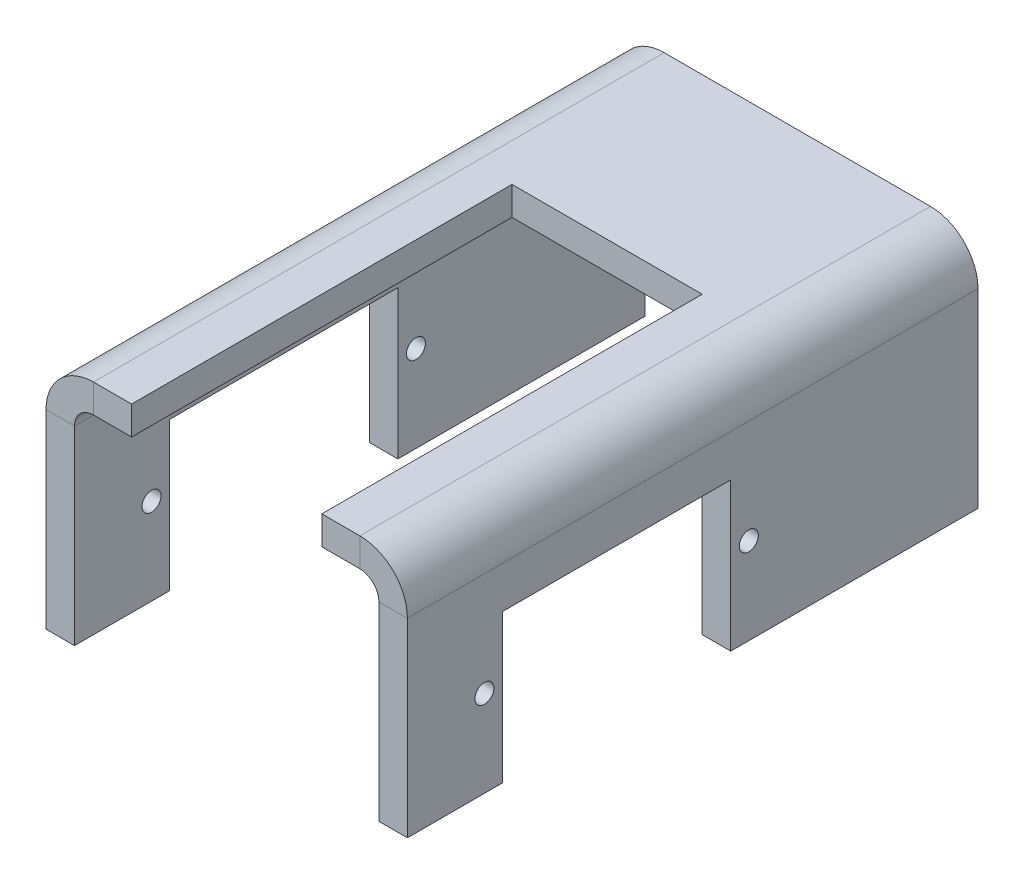
ISO-10303-21;
HEADER;
FILE_DESCRIPTION(('STEP AP214'),'2;1');
FILE_NAME('part.step','',(''),(''),'','','');
FILE_SCHEMA(('AUTOMOTIVE_DESIGN { 1 0 10303 214 1 1 1 1 }'));
ENDSEC;
DATA;
#1=APPLICATION_CONTEXT('core data for automotive mechanical design processes');
#2=APPLICATION_PROTOCOL_DEFINITION('international standard','automotive_design',2000,#1);
#3=PRODUCT_CONTEXT('',#1,'mechanical');
#4=PRODUCT('Part','Part','',(#3));
#5=PRODUCT_RELATED_PRODUCT_CATEGORY('part','',(#4));
#6=PRODUCT_DEFINITION_FORMATION('','',#4);
#7=PRODUCT_DEFINITION_CONTEXT('part definition',#1,'design');
#8=PRODUCT_DEFINITION('design','',#6,#7);
#9=PRODUCT_DEFINITION_SHAPE('','',#8);
#10=(LENGTH_UNIT() NAMED_UNIT(*) SI_UNIT(.MILLI.,.METRE.));
#11=(NAMED_UNIT(*) PLANE_ANGLE_UNIT() SI_UNIT($,.RADIAN.));
#12=(NAMED_UNIT(*) SI_UNIT($,.STERADIAN.) SOLID_ANGLE_UNIT());
#13=UNCERTAINTY_MEASURE_WITH_UNIT(LENGTH_MEASURE(1.E-05),#10,'distance_accuracy_value','');
#14=(GEOMETRIC_REPRESENTATION_CONTEXT(3) GLOBAL_UNCERTAINTY_ASSIGNED_CONTEXT((#13)) GLOBAL_UNIT_ASSIGNED_CONTEXT((#10,
#11,#12)) REPRESENTATION_CONTEXT('',''));
#15=CARTESIAN_POINT('',(0.,0.,0.));
#16=DIRECTION('',(0.,0.,1.));
#17=DIRECTION('',(1.,0.,0.));
#18=AXIS2_PLACEMENT_3D('',#15,#16,#17);
#19=CARTESIAN_POINT('',(15.5000000000001,-25.,-10.7919254658385));
#20=DIRECTION('',(0.,1.,0.));
#21=DIRECTION('',(-1.,0.,0.));
#22=AXIS2_PLACEMENT_3D('',#19,#20,#21);
#23=PLANE('',#22);
#24=DIRECTION('',(0.,0.,-1.));
#25=VECTOR('',#24,1.);
#26=CARTESIAN_POINT('',(12.5000000000001,-25.,-10.7919254658385));
#27=LINE('',#26,#25);
#28=CARTESIAN_POINT('',(12.5000000000001,-25.,49.2080745341615));
#29=VERTEX_POINT('',#28);
#30=CARTESIAN_POINT('',(12.5000000000001,-25.,39.2080745341615));
#31=VERTEX_POINT('',#30);
#32=EDGE_CURVE('E301',#29,#31,#27,.T.);
#33=ORIENTED_EDGE('',*,*,#32,.T.);
#34=DIRECTION('',(1.,0.,0.));
#35=VECTOR('',#34,1.);
#36=CARTESIAN_POINT('',(-22.5000000000001,-25.0000000000001,39.2080745341615));
#37=LINE('',#36,#35);
#38=CARTESIAN_POINT('',(15.5000000000001,-25.,39.2080745341615));
#39=VERTEX_POINT('',#38);
#40=EDGE_CURVE('E225',#31,#39,#37,.T.);
#41=ORIENTED_EDGE('',*,*,#40,.T.);
#42=DIRECTION('',(0.,0.,-1.));
#43=VECTOR('',#42,1.);
#44=CARTESIAN_POINT('',(15.5000000000001,-25.,-10.7919254658385));
#45=LINE('',#44,#43);
#46=CARTESIAN_POINT('',(15.5000000000001,-25.,49.2080745341615));
#47=VERTEX_POINT('',#46);
#48=EDGE_CURVE('E292',#47,#39,#45,.T.);
#49=ORIENTED_EDGE('',*,*,#48,.F.);
#50=DIRECTION('',(-1.,0.,0.));
#51=VECTOR('',#50,1.);
#52=CARTESIAN_POINT('',(15.5000000000001,-25.,49.2080745341615));
#53=LINE('',#52,#51);
#54=EDGE_CURVE('E308',#47,#29,#53,.T.);
#55=ORIENTED_EDGE('',*,*,#54,.T.);
#56=EDGE_LOOP('',(#33,#41,#49,#55));
#57=FACE_BOUND('',#56,.T.);
#58=ADVANCED_FACE('F39',(#57),#23,.F.);
#59=CARTESIAN_POINT('',(-22.5000000000001,-25.,-10.7919254658385));
#60=DIRECTION('',(0.,1.,0.));
#61=DIRECTION('',(-1.,0.,0.));
#62=AXIS2_PLACEMENT_3D('',#59,#60,#61);
#63=PLANE('',#62);
#64=DIRECTION('',(0.,0.,1.));
#65=VECTOR('',#64,1.);
#66=CARTESIAN_POINT('',(-22.5000000000001,-25.,-10.7919254658385));
#67=LINE('',#66,#65);
#68=CARTESIAN_POINT('',(-22.5000000000001,-25.0000000000001,39.2080745341615));
#69=VERTEX_POINT('',#68);
#70=CARTESIAN_POINT('',(-22.5000000000001,-25.,49.2080745341615));
#71=VERTEX_POINT('',#70);
#72=EDGE_CURVE('E207',#69,#71,#67,.T.);
#73=ORIENTED_EDGE('',*,*,#72,.F.);
#74=CARTESIAN_POINT('',(-19.5000000000001,-25.0000000000001,39.2080745341615));
#75=VERTEX_POINT('',#74);
#76=EDGE_CURVE('E218',#69,#75,#37,.T.);
#77=ORIENTED_EDGE('',*,*,#76,.T.);
#78=DIRECTION('',(0.,0.,1.));
#79=VECTOR('',#78,1.);
#80=CARTESIAN_POINT('',(-19.5000000000001,-25.,-10.7919254658385));
#81=LINE('',#80,#79);
#82=CARTESIAN_POINT('',(-19.5000000000001,-25.,49.2080745341615));
#83=VERTEX_POINT('',#82);
#84=EDGE_CURVE('E243',#75,#83,#81,.T.);
#85=ORIENTED_EDGE('',*,*,#84,.T.);
#86=DIRECTION('',(1.,0.,0.));
#87=VECTOR('',#86,1.);
#88=CARTESIAN_POINT('',(-22.5000000000001,-25.,49.2080745341615));
#89=LINE('',#88,#87);
#90=EDGE_CURVE('E229',#71,#83,#89,.T.);
#91=ORIENTED_EDGE('',*,*,#90,.F.);
#92=EDGE_LOOP('',(#73,#77,#85,#91));
#93=FACE_BOUND('',#92,.T.);
#94=ADVANCED_FACE('F227',(#93),#63,.F.);
#95=CARTESIAN_POINT('',(-19.5,-3.,49.2080745341615));
#96=DIRECTION('',(0.,0.,1.));
#97=DIRECTION('',(1.,0.,0.));
#98=AXIS2_PLACEMENT_3D('',#95,#96,#97);
#99=PLANE('',#98);
#100=DIRECTION('',(0.,-1.,0.));
#101=VECTOR('',#100,1.);
#102=CARTESIAN_POINT('',(-13.5,-3.,49.2080745341615));
#103=LINE('',#102,#101);
#104=CARTESIAN_POINT('',(-13.5,0.,49.2080745341615));
#105=VERTEX_POINT('',#104);
#106=CARTESIAN_POINT('',(-13.5,-3.00000000000001,49.2080745341615));
#107=VERTEX_POINT('',#106);
#108=EDGE_CURVE('E11',#105,#107,#103,.T.);
#109=ORIENTED_EDGE('',*,*,#108,.F.);
#110=DIRECTION('',(1.,0.,0.));
#111=VECTOR('',#110,1.);
#112=CARTESIAN_POINT('',(-19.5,0.,49.2080745341615));
#113=LINE('',#112,#111);
#114=CARTESIAN_POINT('',(-17.5,0.,49.2080745341615));
#115=VERTEX_POINT('',#114);
#116=EDGE_CURVE('E336',#115,#105,#113,.T.);
#117=ORIENTED_EDGE('',*,*,#116,.F.);
#118=DIRECTION('',(0.,1.,0.));
#119=VECTOR('',#118,1.);
#120=CARTESIAN_POINT('',(-17.5,-3.,49.2080745341615));
#121=LINE('',#120,#119);
#122=CARTESIAN_POINT('',(-17.5,-3.,49.2080745341615));
#123=VERTEX_POINT('',#122);
#124=EDGE_CURVE('E272',#123,#115,#121,.T.);
#125=ORIENTED_EDGE('',*,*,#124,.F.);
#126=DIRECTION('',(1.,0.,0.));
#127=VECTOR('',#126,1.);
#128=CARTESIAN_POINT('',(-19.5,-3.,49.2080745341615));
#129=LINE('',#128,#127);
#130=EDGE_CURVE('E337',#123,#107,#129,.T.);
#131=ORIENTED_EDGE('',*,*,#130,.T.);
#132=EDGE_LOOP('',(#109,#117,#125,#131));
#133=FACE_BOUND('',#132,.T.);
#134=ADVANCED_FACE('F531',(#133),#99,.T.);
#135=CARTESIAN_POINT('',(0.,-3.,0.));
#136=DIRECTION('',(0.,1.,0.));
#137=DIRECTION('',(0.,0.,1.));
#138=AXIS2_PLACEMENT_3D('',#135,#136,#137);
#139=PLANE('',#138);
#140=DIRECTION('',(-1.,0.,0.));
#141=VECTOR('',#140,1.);
#142=CARTESIAN_POINT('',(0.,-3.,9.2080745341615));
#143=LINE('',#142,#141);
#144=CARTESIAN_POINT('',(6.50000000000001,-3.00000000000001,9.2080745341615));
#145=VERTEX_POINT('',#144);
#146=CARTESIAN_POINT('',(-13.5,-3.00000000000001,9.2080745341615));
#147=VERTEX_POINT('',#146);
#148=EDGE_CURVE('E417',#145,#147,#143,.T.);
#149=ORIENTED_EDGE('',*,*,#148,.T.);
#150=DIRECTION('',(0.,0.,1.));
#151=VECTOR('',#150,1.);
#152=CARTESIAN_POINT('',(-13.5,-3.,0.));
#153=LINE('',#152,#151);
#154=EDGE_CURVE('E421',#147,#107,#153,.T.);
#155=ORIENTED_EDGE('',*,*,#154,.T.);
#156=ORIENTED_EDGE('',*,*,#130,.F.);
#157=DIRECTION('',(0.,0.,-1.));
#158=VECTOR('',#157,1.);
#159=CARTESIAN_POINT('',(-17.5,-3.,-10.7919254658385));
#160=LINE('',#159,#158);
#161=CARTESIAN_POINT('',(-17.5,-3.,-10.7919254658385));
#162=VERTEX_POINT('',#161);
#163=EDGE_CURVE('E268',#162,#123,#160,.F.);
#164=ORIENTED_EDGE('',*,*,#163,.F.);
#165=DIRECTION('',(-1.,0.,0.));
#166=VECTOR('',#165,1.);
#167=CARTESIAN_POINT('',(-19.5,-3.,-10.7919254658385));
#168=LINE('',#167,#166);
#169=CARTESIAN_POINT('',(10.5,-3.00000000000001,-10.7919254658385));
#170=VERTEX_POINT('',#169);
#171=EDGE_CURVE('E332',#170,#162,#168,.T.);
#172=ORIENTED_EDGE('',*,*,#171,.F.);
#173=DIRECTION('',(0.,0.,1.));
#174=VECTOR('',#173,1.);
#175=CARTESIAN_POINT('',(10.5,-3.00000000000001,49.2080745341615));
#176=LINE('',#175,#174);
#177=CARTESIAN_POINT('',(10.5,-3.00000000000001,49.2080745341615));
#178=VERTEX_POINT('',#177);
#179=EDGE_CURVE('E323',#178,#170,#176,.F.);
#180=ORIENTED_EDGE('',*,*,#179,.F.);
#181=CARTESIAN_POINT('',(6.50000000000001,-3.,49.2080745341615));
#182=VERTEX_POINT('',#181);
#183=EDGE_CURVE('E335',#182,#178,#129,.T.);
#184=ORIENTED_EDGE('',*,*,#183,.F.);
#185=DIRECTION('',(0.,0.,-1.));
#186=VECTOR('',#185,1.);
#187=CARTESIAN_POINT('',(6.50000000000001,-3.,0.));
#188=LINE('',#187,#186);
#189=EDGE_CURVE('E54',#182,#145,#188,.T.);
#190=ORIENTED_EDGE('',*,*,#189,.T.);
#191=EDGE_LOOP('',(#149,#155,#156,#164,#172,#180,#184,#190));
#192=FACE_BOUND('',#191,.T.);
#193=ADVANCED_FACE('F388',(#192),#139,.F.);
#194=CARTESIAN_POINT('',(0.,0.,0.));
#195=DIRECTION('',(0.,1.,0.));
#196=DIRECTION('',(0.,0.,1.));
#197=AXIS2_PLACEMENT_3D('',#194,#195,#196);
#198=PLANE('',#197);
#199=DIRECTION('',(0.,0.,1.));
#200=VECTOR('',#199,1.);
#201=CARTESIAN_POINT('',(-13.5,0.,9.2080745341615));
#202=LINE('',#201,#200);
#203=CARTESIAN_POINT('',(-13.5,0.,9.2080745341615));
#204=VERTEX_POINT('',#203);
#205=EDGE_CURVE('E372',#204,#105,#202,.T.);
#206=ORIENTED_EDGE('',*,*,#205,.F.);
#207=DIRECTION('',(-1.,0.,0.));
#208=VECTOR('',#207,1.);
#209=CARTESIAN_POINT('',(-13.5,0.,9.2080745341615));
#210=LINE('',#209,#208);
#211=CARTESIAN_POINT('',(6.50000000000001,0.,9.2080745341615));
#212=VERTEX_POINT('',#211);
#213=EDGE_CURVE('E371',#212,#204,#210,.T.);
#214=ORIENTED_EDGE('',*,*,#213,.F.);
#215=DIRECTION('',(0.,0.,-1.));
#216=VECTOR('',#215,1.);
#217=CARTESIAN_POINT('',(6.50000000000001,0.,9.2080745341615));
#218=LINE('',#217,#216);
#219=CARTESIAN_POINT('',(6.50000000000001,0.,49.2080745341615));
#220=VERTEX_POINT('',#219);
#221=EDGE_CURVE('E362',#220,#212,#218,.T.);
#222=ORIENTED_EDGE('',*,*,#221,.F.);
#223=CARTESIAN_POINT('',(10.5,0.,49.2080745341615));
#224=VERTEX_POINT('',#223);
#225=EDGE_CURVE('E343',#220,#224,#113,.T.);
#226=ORIENTED_EDGE('',*,*,#225,.T.);
#227=DIRECTION('',(0.,0.,1.));
#228=VECTOR('',#227,1.);
#229=CARTESIAN_POINT('',(10.5,0.,49.2080745341615));
#230=LINE('',#229,#228);
#231=CARTESIAN_POINT('',(10.5,0.,-10.7919254658385));
#232=VERTEX_POINT('',#231);
#233=EDGE_CURVE('E312',#224,#232,#230,.F.);
#234=ORIENTED_EDGE('',*,*,#233,.T.);
#235=DIRECTION('',(-1.,0.,0.));
#236=VECTOR('',#235,1.);
#237=CARTESIAN_POINT('',(-19.5,0.,-10.7919254658385));
#238=LINE('',#237,#236);
#239=CARTESIAN_POINT('',(-17.5,0.,-10.7919254658385));
#240=VERTEX_POINT('',#239);
#241=EDGE_CURVE('E329',#232,#240,#238,.T.);
#242=ORIENTED_EDGE('',*,*,#241,.T.);
#243=DIRECTION('',(0.,0.,-1.));
#244=VECTOR('',#243,1.);
#245=CARTESIAN_POINT('',(-17.5,0.,-10.7919254658385));
#246=LINE('',#245,#244);
#247=EDGE_CURVE('E255',#240,#115,#246,.F.);
#248=ORIENTED_EDGE('',*,*,#247,.T.);
#249=ORIENTED_EDGE('',*,*,#116,.T.);
#250=EDGE_LOOP('',(#206,#214,#222,#226,#234,#242,#248,#249));
#251=FACE_BOUND('',#250,.T.);
#252=ADVANCED_FACE('F369',(#251),#198,.T.);
#253=CARTESIAN_POINT('',(-19.5,-3.,-10.7919254658385));
#254=DIRECTION('',(0.,0.,-1.));
#255=DIRECTION('',(-1.,0.,0.));
#256=AXIS2_PLACEMENT_3D('',#253,#254,#255);
#257=PLANE('',#256);
#258=ORIENTED_EDGE('',*,*,#171,.T.);
#259=DIRECTION('',(0.,1.,0.));
#260=VECTOR('',#259,1.);
#261=CARTESIAN_POINT('',(-17.5,-3.,-10.7919254658385));
#262=LINE('',#261,#260);
#263=EDGE_CURVE('E262',#162,#240,#262,.T.);
#264=ORIENTED_EDGE('',*,*,#263,.T.);
#265=ORIENTED_EDGE('',*,*,#241,.F.);
#266=DIRECTION('',(0.,1.,0.));
#267=VECTOR('',#266,1.);
#268=CARTESIAN_POINT('',(10.5,-3.00000000000001,-10.7919254658385));
#269=LINE('',#268,#267);
#270=EDGE_CURVE('E327',#170,#232,#269,.T.);
#271=ORIENTED_EDGE('',*,*,#270,.F.);
#272=EDGE_LOOP('',(#258,#264,#265,#271));
#273=FACE_BOUND('',#272,.T.);
#274=ADVANCED_FACE('F41',(#273),#257,.T.);
#275=DIRECTION('',(0.,1.,0.));
#276=VECTOR('',#275,1.);
#277=CARTESIAN_POINT('',(6.50000000000001,-3.,49.2080745341615));
#278=LINE('',#277,#276);
#279=EDGE_CURVE('E47',#182,#220,#278,.T.);
#280=ORIENTED_EDGE('',*,*,#279,.F.);
#281=ORIENTED_EDGE('',*,*,#183,.T.);
#282=DIRECTION('',(0.,1.,0.));
#283=VECTOR('',#282,1.);
#284=CARTESIAN_POINT('',(10.5,-3.00000000000001,49.2080745341615));
#285=LINE('',#284,#283);
#286=EDGE_CURVE('E317',#178,#224,#285,.T.);
#287=ORIENTED_EDGE('',*,*,#286,.T.);
#288=ORIENTED_EDGE('',*,*,#225,.F.);
#289=EDGE_LOOP('',(#280,#281,#287,#288));
#290=FACE_BOUND('',#289,.T.);
#291=ADVANCED_FACE('F374',(#290),#99,.T.);
#292=CARTESIAN_POINT('',(10.5,-5.,-10.7919254658385));
#293=DIRECTION('',(0.,0.,-1.));
#294=DIRECTION('',(-1.,0.,0.));
#295=AXIS2_PLACEMENT_3D('',#292,#293,#294);
#296=PLANE('',#295);
#297=DIRECTION('',(1.,0.,0.));
#298=VECTOR('',#297,1.);
#299=CARTESIAN_POINT('',(12.5,-4.99999999999999,-10.7919254658385));
#300=LINE('',#299,#298);
#301=CARTESIAN_POINT('',(12.5,-4.99999999999999,-10.7919254658385));
#302=VERTEX_POINT('',#301);
#303=CARTESIAN_POINT('',(15.5,-4.99999999999998,-10.7919254658385));
#304=VERTEX_POINT('',#303);
#305=EDGE_CURVE('E275',#302,#304,#300,.T.);
#306=ORIENTED_EDGE('',*,*,#305,.F.);
#307=CARTESIAN_POINT('',(10.5,-5.,-10.7919254658385));
#308=DIRECTION('',(0.,0.,1.));
#309=DIRECTION('',(1.,0.,0.));
#310=AXIS2_PLACEMENT_3D('',#307,#308,#309);
#311=CIRCLE('',#310,1.99999999999999);
#312=EDGE_CURVE('E320',#170,#302,#311,.F.);
#313=ORIENTED_EDGE('',*,*,#312,.F.);
#314=ORIENTED_EDGE('',*,*,#270,.T.);
#315=CARTESIAN_POINT('',(10.5,-5.,-10.7919254658385));
#316=DIRECTION('',(0.,0.,1.));
#317=DIRECTION('',(1.,0.,0.));
#318=AXIS2_PLACEMENT_3D('',#315,#316,#317);
#319=CIRCLE('',#318,4.99999999999999);
#320=EDGE_CURVE('E62',#232,#304,#319,.F.);
#321=ORIENTED_EDGE('',*,*,#320,.T.);
#322=EDGE_LOOP('',(#306,#313,#314,#321));
#323=FACE_BOUND('',#322,.T.);
#324=ADVANCED_FACE('F395',(#323),#296,.T.);
#325=CARTESIAN_POINT('',(10.5,-5.,49.2080745341615));
#326=DIRECTION('',(0.,0.,-1.));
#327=DIRECTION('',(-1.,0.,0.));
#328=AXIS2_PLACEMENT_3D('',#325,#326,#327);
#329=PLANE('',#328);
#330=CARTESIAN_POINT('',(10.5,-5.,49.2080745341615));
#331=DIRECTION('',(0.,0.,1.));
#332=DIRECTION('',(1.,0.,0.));
#333=AXIS2_PLACEMENT_3D('',#330,#331,#332);
#334=CIRCLE('',#333,1.99999999999999);
#335=CARTESIAN_POINT('',(12.5,-4.99999999999999,49.2080745341615));
#336=VERTEX_POINT('',#335);
#337=EDGE_CURVE('E311',#336,#178,#334,.T.);
#338=ORIENTED_EDGE('',*,*,#337,.F.);
#339=DIRECTION('',(1.,0.,0.));
#340=VECTOR('',#339,1.);
#341=CARTESIAN_POINT('',(12.5,-5.,49.2080745341615));
#342=LINE('',#341,#340);
#343=CARTESIAN_POINT('',(15.5,-4.99999999999999,49.2080745341615));
#344=VERTEX_POINT('',#343);
#345=EDGE_CURVE('E280',#336,#344,#342,.T.);
#346=ORIENTED_EDGE('',*,*,#345,.T.);
#347=CARTESIAN_POINT('',(10.5,-5.,49.2080745341615));
#348=DIRECTION('',(0.,0.,1.));
#349=DIRECTION('',(1.,0.,0.));
#350=AXIS2_PLACEMENT_3D('',#347,#348,#349);
#351=CIRCLE('',#350,4.99999999999999);
#352=EDGE_CURVE('E315',#344,#224,#351,.T.);
#353=ORIENTED_EDGE('',*,*,#352,.T.);
#354=ORIENTED_EDGE('',*,*,#286,.F.);
#355=EDGE_LOOP('',(#338,#346,#353,#354));
#356=FACE_BOUND('',#355,.T.);
#357=ADVANCED_FACE('F378',(#356),#329,.F.);
#358=CARTESIAN_POINT('',(10.5,-5.,49.2080745341615));
#359=DIRECTION('',(0.,0.,1.));
#360=DIRECTION('',(1.,0.,0.));
#361=AXIS2_PLACEMENT_3D('',#358,#359,#360);
#362=CYLINDRICAL_SURFACE('',#361,4.99999999999999);
#363=ORIENTED_EDGE('',*,*,#233,.F.);
#364=ORIENTED_EDGE('',*,*,#352,.F.);
#365=DIRECTION('',(0.,0.,-1.));
#366=VECTOR('',#365,1.);
#367=CARTESIAN_POINT('',(15.5,-4.99999999999998,0.));
#368=LINE('',#367,#366);
#369=EDGE_CURVE('E283',#344,#304,#368,.T.);
#370=ORIENTED_EDGE('',*,*,#369,.T.);
#371=ORIENTED_EDGE('',*,*,#320,.F.);
#372=EDGE_LOOP('',(#363,#364,#370,#371));
#373=FACE_BOUND('',#372,.T.);
#374=ADVANCED_FACE('F396',(#373),#362,.T.);
#375=CARTESIAN_POINT('',(10.5,-5.,49.2080745341615));
#376=DIRECTION('',(0.,0.,1.));
#377=DIRECTION('',(1.,0.,0.));
#378=AXIS2_PLACEMENT_3D('',#375,#376,#377);
#379=CYLINDRICAL_SURFACE('',#378,1.99999999999999);
#380=ORIENTED_EDGE('',*,*,#179,.T.);
#381=ORIENTED_EDGE('',*,*,#312,.T.);
#382=DIRECTION('',(0.,0.,1.));
#383=VECTOR('',#382,1.);
#384=CARTESIAN_POINT('',(12.5,-4.99999999999999,-10.7919254658385));
#385=LINE('',#384,#383);
#386=EDGE_CURVE('E278',#302,#336,#385,.T.);
#387=ORIENTED_EDGE('',*,*,#386,.T.);
#388=ORIENTED_EDGE('',*,*,#337,.T.);
#389=EDGE_LOOP('',(#380,#381,#387,#388));
#390=FACE_BOUND('',#389,.T.);
#391=ADVANCED_FACE('F382',(#390),#379,.F.);
#392=CARTESIAN_POINT('',(15.5000000000001,-25.,49.2080745341615));
#393=DIRECTION('',(0.,0.,-1.));
#394=DIRECTION('',(-1.,0.,0.));
#395=AXIS2_PLACEMENT_3D('',#392,#393,#394);
#396=PLANE('',#395);
#397=ORIENTED_EDGE('',*,*,#345,.F.);
#398=DIRECTION('',(0.,-1.,0.));
#399=VECTOR('',#398,1.);
#400=CARTESIAN_POINT('',(12.5000000000001,-25.,49.2080745341615));
#401=LINE('',#400,#399);
#402=EDGE_CURVE('E287',#336,#29,#401,.T.);
#403=ORIENTED_EDGE('',*,*,#402,.T.);
#404=ORIENTED_EDGE('',*,*,#54,.F.);
#405=DIRECTION('',(0.,-1.,0.));
#406=VECTOR('',#405,1.);
#407=CARTESIAN_POINT('',(15.5000000000001,-25.,49.2080745341615));
#408=LINE('',#407,#406);
#409=EDGE_CURVE('E288',#344,#47,#408,.T.);
#410=ORIENTED_EDGE('',*,*,#409,.F.);
#411=EDGE_LOOP('',(#397,#403,#404,#410));
#412=FACE_BOUND('',#411,.T.);
#413=ADVANCED_FACE('F405',(#412),#396,.F.);
#414=CARTESIAN_POINT('',(15.5,-2.99999999999999,-10.7919254658385));
#415=DIRECTION('',(0.,0.,1.));
#416=DIRECTION('',(1.,0.,0.));
#417=AXIS2_PLACEMENT_3D('',#414,#415,#416);
#418=PLANE('',#417);
#419=ORIENTED_EDGE('',*,*,#305,.T.);
#420=DIRECTION('',(0.,1.,0.));
#421=VECTOR('',#420,1.);
#422=CARTESIAN_POINT('',(15.5,-2.99999999999999,-10.7919254658385));
#423=LINE('',#422,#421);
#424=CARTESIAN_POINT('',(15.5000000000001,-25.,-10.7919254658385));
#425=VERTEX_POINT('',#424);
#426=EDGE_CURVE('E295',#425,#304,#423,.T.);
#427=ORIENTED_EDGE('',*,*,#426,.F.);
#428=DIRECTION('',(-1.,0.,0.));
#429=VECTOR('',#428,1.);
#430=CARTESIAN_POINT('',(15.5000000000001,-25.,-10.7919254658385));
#431=LINE('',#430,#429);
#432=CARTESIAN_POINT('',(12.5000000000001,-25.,-10.7919254658385));
#433=VERTEX_POINT('',#432);
#434=EDGE_CURVE('E298',#425,#433,#431,.T.);
#435=ORIENTED_EDGE('',*,*,#434,.T.);
#436=DIRECTION('',(0.,1.,0.));
#437=VECTOR('',#436,1.);
#438=CARTESIAN_POINT('',(12.5,-3.,-10.7919254658385));
#439=LINE('',#438,#437);
#440=EDGE_CURVE('E291',#433,#302,#439,.T.);
#441=ORIENTED_EDGE('',*,*,#440,.T.);
#442=EDGE_LOOP('',(#419,#427,#435,#441));
#443=FACE_BOUND('',#442,.T.);
#444=ADVANCED_FACE('F501',(#443),#418,.F.);
#445=CARTESIAN_POINT('',(15.5,0.,0.));
#446=DIRECTION('',(-1.,0.,0.));
#447=DIRECTION('',(0.,-1.,0.));
#448=AXIS2_PLACEMENT_3D('',#445,#446,#447);
#449=PLANE('',#448);
#450=CARTESIAN_POINT('',(15.5000000000001,-15.8992881888773,41.1080745341615));
#451=DIRECTION('',(1.,0.,0.));
#452=DIRECTION('',(0.,1.,0.));
#453=AXIS2_PLACEMENT_3D('',#450,#451,#452);
#454=CIRCLE('',#453,0.999999999999999);
#455=CARTESIAN_POINT('',(15.5,-14.8992881888773,41.1080745341615));
#456=VERTEX_POINT('',#455);
#457=EDGE_CURVE('E474',#456,#456,#454,.T.);
#458=ORIENTED_EDGE('',*,*,#457,.F.);
#459=EDGE_LOOP('',(#458));
#460=FACE_BOUND('',#459,.T.);
#461=CARTESIAN_POINT('',(15.5,-15.8992881888773,13.3080745341615));
#462=DIRECTION('',(1.,0.,0.));
#463=DIRECTION('',(0.,1.,0.));
#464=AXIS2_PLACEMENT_3D('',#461,#462,#463);
#465=CIRCLE('',#464,0.999999999999998);
#466=CARTESIAN_POINT('',(15.5,-14.8992881888773,13.3080745341615));
#467=VERTEX_POINT('',#466);
#468=EDGE_CURVE('E429',#467,#467,#465,.T.);
#469=ORIENTED_EDGE('',*,*,#468,.F.);
#470=EDGE_LOOP('',(#469));
#471=FACE_BOUND('',#470,.T.);
#472=ORIENTED_EDGE('',*,*,#48,.T.);
#473=DIRECTION('',(0.,-1.,0.));
#474=VECTOR('',#473,1.);
#475=CARTESIAN_POINT('',(15.5,-9.39928818887731,39.2080745341615));
#476=LINE('',#475,#474);
#477=CARTESIAN_POINT('',(15.5,-9.39928818887731,39.2080745341615));
#478=VERTEX_POINT('',#477);
#479=EDGE_CURVE('E413',#478,#39,#476,.T.);
#480=ORIENTED_EDGE('',*,*,#479,.F.);
#481=DIRECTION('',(0.,0.,1.));
#482=VECTOR('',#481,1.);
#483=CARTESIAN_POINT('',(15.5,-9.39928818887731,39.2080745341615));
#484=LINE('',#483,#482);
#485=CARTESIAN_POINT('',(15.5,-9.39928818887731,15.2080745341615));
#486=VERTEX_POINT('',#485);
#487=EDGE_CURVE('E215',#486,#478,#484,.T.);
#488=ORIENTED_EDGE('',*,*,#487,.F.);
#489=DIRECTION('',(0.,1.,0.));
#490=VECTOR('',#489,1.);
#491=CARTESIAN_POINT('',(15.5,-9.39928818887731,15.2080745341615));
#492=LINE('',#491,#490);
#493=CARTESIAN_POINT('',(15.5000000000001,-25.,15.2080745341615));
#494=VERTEX_POINT('',#493);
#495=EDGE_CURVE('E416',#494,#486,#492,.T.);
#496=ORIENTED_EDGE('',*,*,#495,.F.);
#497=EDGE_CURVE('E290',#494,#425,#45,.T.);
#498=ORIENTED_EDGE('',*,*,#497,.T.);
#499=ORIENTED_EDGE('',*,*,#426,.T.);
#500=ORIENTED_EDGE('',*,*,#369,.F.);
#501=ORIENTED_EDGE('',*,*,#409,.T.);
#502=EDGE_LOOP('',(#472,#480,#488,#496,#498,#499,#500,#501));
#503=FACE_BOUND('',#502,.T.);
#504=ADVANCED_FACE('F402',(#460,#471,#503),#449,.F.);
#505=CARTESIAN_POINT('',(12.5,0.,0.));
#506=DIRECTION('',(-1.,0.,0.));
#507=DIRECTION('',(0.,-1.,0.));
#508=AXIS2_PLACEMENT_3D('',#505,#506,#507);
#509=PLANE('',#508);
#510=DIRECTION('',(0.,1.,0.));
#511=VECTOR('',#510,1.);
#512=CARTESIAN_POINT('',(12.5,0.,39.2080745341615));
#513=LINE('',#512,#511);
#514=CARTESIAN_POINT('',(12.5,-9.39928818887732,39.2080745341615));
#515=VERTEX_POINT('',#514);
#516=EDGE_CURVE('E355',#31,#515,#513,.T.);
#517=ORIENTED_EDGE('',*,*,#516,.F.);
#518=ORIENTED_EDGE('',*,*,#32,.F.);
#519=ORIENTED_EDGE('',*,*,#402,.F.);
#520=ORIENTED_EDGE('',*,*,#386,.F.);
#521=ORIENTED_EDGE('',*,*,#440,.F.);
#522=CARTESIAN_POINT('',(12.5000000000001,-25.,15.2080745341615));
#523=VERTEX_POINT('',#522);
#524=EDGE_CURVE('E300',#523,#433,#27,.T.);
#525=ORIENTED_EDGE('',*,*,#524,.F.);
#526=DIRECTION('',(0.,-1.,0.));
#527=VECTOR('',#526,1.);
#528=CARTESIAN_POINT('',(12.5,0.,15.2080745341615));
#529=LINE('',#528,#527);
#530=CARTESIAN_POINT('',(12.5000000000001,-9.39928818887732,15.2080745341615));
#531=VERTEX_POINT('',#530);
#532=EDGE_CURVE('E435',#531,#523,#529,.T.);
#533=ORIENTED_EDGE('',*,*,#532,.F.);
#534=DIRECTION('',(0.,0.,-1.));
#535=VECTOR('',#534,1.);
#536=CARTESIAN_POINT('',(12.5,-9.39928818887732,0.));
#537=LINE('',#536,#535);
#538=EDGE_CURVE('E437',#515,#531,#537,.T.);
#539=ORIENTED_EDGE('',*,*,#538,.F.);
#540=EDGE_LOOP('',(#517,#518,#519,#520,#521,#525,#533,#539));
#541=FACE_BOUND('',#540,.T.);
#542=CARTESIAN_POINT('',(12.5000000000001,-15.8992881888773,41.1080745341615));
#543=DIRECTION('',(-1.,0.,0.));
#544=DIRECTION('',(0.,-1.,0.));
#545=AXIS2_PLACEMENT_3D('',#542,#543,#544);
#546=CIRCLE('',#545,0.999999999999999);
#547=CARTESIAN_POINT('',(12.5000000000001,-16.8992881888773,41.1080745341615));
#548=VERTEX_POINT('',#547);
#549=EDGE_CURVE('E358',#548,#548,#546,.T.);
#550=ORIENTED_EDGE('',*,*,#549,.F.);
#551=EDGE_LOOP('',(#550));
#552=FACE_BOUND('',#551,.T.);
#553=CARTESIAN_POINT('',(12.5,-15.8992881888773,13.3080745341615));
#554=DIRECTION('',(-1.,0.,0.));
#555=DIRECTION('',(0.,-1.,0.));
#556=AXIS2_PLACEMENT_3D('',#553,#554,#555);
#557=CIRCLE('',#556,0.999999999999998);
#558=CARTESIAN_POINT('',(12.5,-16.8992881888773,13.3080745341615));
#559=VERTEX_POINT('',#558);
#560=EDGE_CURVE('E354',#559,#559,#557,.T.);
#561=ORIENTED_EDGE('',*,*,#560,.F.);
#562=EDGE_LOOP('',(#561));
#563=FACE_BOUND('',#562,.T.);
#564=ADVANCED_FACE('F503',(#541,#552,#563),#509,.T.);
#565=ORIENTED_EDGE('',*,*,#497,.F.);
#566=DIRECTION('',(1.,0.,0.));
#567=VECTOR('',#566,1.);
#568=CARTESIAN_POINT('',(-22.5000000000001,-25.0000000000001,15.2080745341615));
#569=LINE('',#568,#567);
#570=EDGE_CURVE('E224',#523,#494,#569,.T.);
#571=ORIENTED_EDGE('',*,*,#570,.F.);
#572=ORIENTED_EDGE('',*,*,#524,.T.);
#573=ORIENTED_EDGE('',*,*,#434,.F.);
#574=EDGE_LOOP('',(#565,#571,#572,#573));
#575=FACE_BOUND('',#574,.T.);
#576=ADVANCED_FACE('F498',(#575),#23,.F.);
#577=CARTESIAN_POINT('',(-17.5,-5.,49.2080745341615));
#578=DIRECTION('',(0.,0.,1.));
#579=DIRECTION('',(1.,0.,0.));
#580=AXIS2_PLACEMENT_3D('',#577,#578,#579);
#581=PLANE('',#580);
#582=DIRECTION('',(-1.,0.,0.));
#583=VECTOR('',#582,1.);
#584=CARTESIAN_POINT('',(-19.5,-4.99999999999999,49.2080745341615));
#585=LINE('',#584,#583);
#586=CARTESIAN_POINT('',(-19.5,-4.99999999999999,49.2080745341615));
#587=VERTEX_POINT('',#586);
#588=CARTESIAN_POINT('',(-22.5,-4.99999999999998,49.2080745341615));
#589=VERTEX_POINT('',#588);
#590=EDGE_CURVE('E445',#587,#589,#585,.T.);
#591=ORIENTED_EDGE('',*,*,#590,.F.);
#592=CARTESIAN_POINT('',(-17.5,-5.,49.2080745341615));
#593=DIRECTION('',(0.,0.,-1.));
#594=DIRECTION('',(-1.,0.,0.));
#595=AXIS2_PLACEMENT_3D('',#592,#593,#594);
#596=CIRCLE('',#595,1.99999999999999);
#597=EDGE_CURVE('E265',#123,#587,#596,.F.);
#598=ORIENTED_EDGE('',*,*,#597,.F.);
#599=ORIENTED_EDGE('',*,*,#124,.T.);
#600=CARTESIAN_POINT('',(-17.5,-5.,49.2080745341615));
#601=DIRECTION('',(0.,0.,-1.));
#602=DIRECTION('',(-1.,0.,0.));
#603=AXIS2_PLACEMENT_3D('',#600,#601,#602);
#604=CIRCLE('',#603,4.99999999999999);
#605=EDGE_CURVE('E258',#115,#589,#604,.F.);
#606=ORIENTED_EDGE('',*,*,#605,.T.);
#607=EDGE_LOOP('',(#591,#598,#599,#606));
#608=FACE_BOUND('',#607,.T.);
#609=ADVANCED_FACE('F536',(#608),#581,.T.);
#610=CARTESIAN_POINT('',(-17.5,-5.,-10.7919254658385));
#611=DIRECTION('',(0.,0.,1.));
#612=DIRECTION('',(1.,0.,0.));
#613=AXIS2_PLACEMENT_3D('',#610,#611,#612);
#614=PLANE('',#613);
#615=CARTESIAN_POINT('',(-17.5,-5.,-10.7919254658385));
#616=DIRECTION('',(0.,0.,-1.));
#617=DIRECTION('',(-1.,0.,0.));
#618=AXIS2_PLACEMENT_3D('',#615,#616,#617);
#619=CIRCLE('',#618,1.99999999999999);
#620=CARTESIAN_POINT('',(-19.5,-4.99999999999999,-10.7919254658385));
#621=VERTEX_POINT('',#620);
#622=EDGE_CURVE('E254',#621,#162,#619,.T.);
#623=ORIENTED_EDGE('',*,*,#622,.F.);
#624=DIRECTION('',(-1.,0.,0.));
#625=VECTOR('',#624,1.);
#626=CARTESIAN_POINT('',(-19.5,-4.99999999999999,-10.7919254658385));
#627=LINE('',#626,#625);
#628=CARTESIAN_POINT('',(-22.5,-4.99999999999998,-10.7919254658385));
#629=VERTEX_POINT('',#628);
#630=EDGE_CURVE('E448',#621,#629,#627,.T.);
#631=ORIENTED_EDGE('',*,*,#630,.T.);
#632=CARTESIAN_POINT('',(-17.5,-5.,-10.7919254658385));
#633=DIRECTION('',(0.,0.,-1.));
#634=DIRECTION('',(-1.,0.,0.));
#635=AXIS2_PLACEMENT_3D('',#632,#633,#634);
#636=CIRCLE('',#635,4.99999999999999);
#637=EDGE_CURVE('E259',#629,#240,#636,.T.);
#638=ORIENTED_EDGE('',*,*,#637,.T.);
#639=ORIENTED_EDGE('',*,*,#263,.F.);
#640=EDGE_LOOP('',(#623,#631,#638,#639));
#641=FACE_BOUND('',#640,.T.);
#642=ADVANCED_FACE('F541',(#641),#614,.F.);
#643=CARTESIAN_POINT('',(-17.5,-5.,-10.7919254658385));
#644=DIRECTION('',(0.,0.,-1.));
#645=DIRECTION('',(-1.,0.,0.));
#646=AXIS2_PLACEMENT_3D('',#643,#644,#645);
#647=CYLINDRICAL_SURFACE('',#646,4.99999999999999);
#648=ORIENTED_EDGE('',*,*,#247,.F.);
#649=ORIENTED_EDGE('',*,*,#637,.F.);
#650=DIRECTION('',(0.,0.,-1.));
#651=VECTOR('',#650,1.);
#652=CARTESIAN_POINT('',(-22.5,-4.99999999999998,0.));
#653=LINE('',#652,#651);
#654=EDGE_CURVE('E244',#589,#629,#653,.T.);
#655=ORIENTED_EDGE('',*,*,#654,.F.);
#656=ORIENTED_EDGE('',*,*,#605,.F.);
#657=EDGE_LOOP('',(#648,#649,#655,#656));
#658=FACE_BOUND('',#657,.T.);
#659=ADVANCED_FACE('F581',(#658),#647,.T.);
#660=CARTESIAN_POINT('',(-17.5,-5.,-10.7919254658385));
#661=DIRECTION('',(0.,0.,-1.));
#662=DIRECTION('',(-1.,0.,0.));
#663=AXIS2_PLACEMENT_3D('',#660,#661,#662);
#664=CYLINDRICAL_SURFACE('',#663,1.99999999999999);
#665=ORIENTED_EDGE('',*,*,#163,.T.);
#666=ORIENTED_EDGE('',*,*,#597,.T.);
#667=DIRECTION('',(0.,0.,-1.));
#668=VECTOR('',#667,1.);
#669=CARTESIAN_POINT('',(-19.5,-4.99999999999999,49.2080745341615));
#670=LINE('',#669,#668);
#671=EDGE_CURVE('E446',#587,#621,#670,.T.);
#672=ORIENTED_EDGE('',*,*,#671,.T.);
#673=ORIENTED_EDGE('',*,*,#622,.T.);
#674=EDGE_LOOP('',(#665,#666,#672,#673));
#675=FACE_BOUND('',#674,.T.);
#676=ADVANCED_FACE('F594',(#675),#664,.F.);
#677=CARTESIAN_POINT('',(-22.5,-2.99999999999999,-10.7919254658385));
#678=DIRECTION('',(0.,0.,1.));
#679=DIRECTION('',(1.,0.,0.));
#680=AXIS2_PLACEMENT_3D('',#677,#678,#679);
#681=PLANE('',#680);
#682=ORIENTED_EDGE('',*,*,#630,.F.);
#683=DIRECTION('',(0.,-1.,0.));
#684=VECTOR('',#683,1.);
#685=CARTESIAN_POINT('',(-19.5,-3.,-10.7919254658385));
#686=LINE('',#685,#684);
#687=CARTESIAN_POINT('',(-19.5000000000001,-25.,-10.7919254658385));
#688=VERTEX_POINT('',#687);
#689=EDGE_CURVE('E241',#621,#688,#686,.T.);
#690=ORIENTED_EDGE('',*,*,#689,.T.);
#691=DIRECTION('',(1.,0.,0.));
#692=VECTOR('',#691,1.);
#693=CARTESIAN_POINT('',(-22.5000000000001,-25.,-10.7919254658385));
#694=LINE('',#693,#692);
#695=CARTESIAN_POINT('',(-22.5000000000001,-25.,-10.7919254658385));
#696=VERTEX_POINT('',#695);
#697=EDGE_CURVE('E251',#696,#688,#694,.T.);
#698=ORIENTED_EDGE('',*,*,#697,.F.);
#699=DIRECTION('',(0.,-1.,0.));
#700=VECTOR('',#699,1.);
#701=CARTESIAN_POINT('',(-22.5,-2.99999999999999,-10.7919254658385));
#702=LINE('',#701,#700);
#703=EDGE_CURVE('E232',#629,#696,#702,.T.);
#704=ORIENTED_EDGE('',*,*,#703,.F.);
#705=EDGE_LOOP('',(#682,#690,#698,#704));
#706=FACE_BOUND('',#705,.T.);
#707=ADVANCED_FACE('F458',(#706),#681,.F.);
#708=CARTESIAN_POINT('',(-22.5000000000001,-25.,49.2080745341615));
#709=DIRECTION('',(0.,0.,-1.));
#710=DIRECTION('',(-1.,0.,0.));
#711=AXIS2_PLACEMENT_3D('',#708,#709,#710);
#712=PLANE('',#711);
#713=ORIENTED_EDGE('',*,*,#590,.T.);
#714=DIRECTION('',(0.,1.,0.));
#715=VECTOR('',#714,1.);
#716=CARTESIAN_POINT('',(-22.5000000000001,-25.,49.2080745341615));
#717=LINE('',#716,#715);
#718=EDGE_CURVE('E235',#71,#589,#717,.T.);
#719=ORIENTED_EDGE('',*,*,#718,.F.);
#720=ORIENTED_EDGE('',*,*,#90,.T.);
#721=DIRECTION('',(0.,1.,0.));
#722=VECTOR('',#721,1.);
#723=CARTESIAN_POINT('',(-19.5000000000001,-25.,49.2080745341615));
#724=LINE('',#723,#722);
#725=EDGE_CURVE('E236',#83,#587,#724,.T.);
#726=ORIENTED_EDGE('',*,*,#725,.T.);
#727=EDGE_LOOP('',(#713,#719,#720,#726));
#728=FACE_BOUND('',#727,.T.);
#729=ADVANCED_FACE('F592',(#728),#712,.F.);
#730=CARTESIAN_POINT('',(-22.5,0.,0.));
#731=DIRECTION('',(-1.,0.,0.));
#732=DIRECTION('',(0.,-1.,0.));
#733=AXIS2_PLACEMENT_3D('',#730,#731,#732);
#734=PLANE('',#733);
#735=DIRECTION('',(0.,-1.,0.));
#736=VECTOR('',#735,1.);
#737=CARTESIAN_POINT('',(-22.5000000000001,-9.39928818887744,39.2080745341615));
#738=LINE('',#737,#736);
#739=CARTESIAN_POINT('',(-22.5000000000001,-9.39928818887744,39.2080745341615));
#740=VERTEX_POINT('',#739);
#741=EDGE_CURVE('E201',#740,#69,#738,.T.);
#742=ORIENTED_EDGE('',*,*,#741,.T.);
#743=ORIENTED_EDGE('',*,*,#72,.T.);
#744=ORIENTED_EDGE('',*,*,#718,.T.);
#745=ORIENTED_EDGE('',*,*,#654,.T.);
#746=ORIENTED_EDGE('',*,*,#703,.T.);
#747=CARTESIAN_POINT('',(-22.5000000000001,-25.0000000000001,15.2080745341615));
#748=VERTEX_POINT('',#747);
#749=EDGE_CURVE('E231',#696,#748,#67,.T.);
#750=ORIENTED_EDGE('',*,*,#749,.T.);
#751=DIRECTION('',(0.,1.,0.));
#752=VECTOR('',#751,1.);
#753=CARTESIAN_POINT('',(-22.5000000000001,-9.39928818887744,15.2080745341615));
#754=LINE('',#753,#752);
#755=CARTESIAN_POINT('',(-22.5000000000001,-9.39928818887744,15.2080745341615));
#756=VERTEX_POINT('',#755);
#757=EDGE_CURVE('E214',#748,#756,#754,.T.);
#758=ORIENTED_EDGE('',*,*,#757,.T.);
#759=DIRECTION('',(0.,0.,1.));
#760=VECTOR('',#759,1.);
#761=CARTESIAN_POINT('',(-22.5000000000001,-9.39928818887744,39.2080745341615));
#762=LINE('',#761,#760);
#763=EDGE_CURVE('E211',#756,#740,#762,.T.);
#764=ORIENTED_EDGE('',*,*,#763,.T.);
#765=EDGE_LOOP('',(#742,#743,#744,#745,#746,#750,#758,#764));
#766=FACE_BOUND('',#765,.T.);
#767=CARTESIAN_POINT('',(-22.5000000000001,-15.8992881888774,41.1080745341615));
#768=DIRECTION('',(1.,0.,0.));
#769=DIRECTION('',(0.,1.,0.));
#770=AXIS2_PLACEMENT_3D('',#767,#768,#769);
#771=CIRCLE('',#770,0.999999999999999);
#772=CARTESIAN_POINT('',(-22.5000000000001,-14.8992881888774,41.1080745341615));
#773=VERTEX_POINT('',#772);
#774=EDGE_CURVE('E438',#773,#773,#771,.T.);
#775=ORIENTED_EDGE('',*,*,#774,.T.);
#776=EDGE_LOOP('',(#775));
#777=FACE_BOUND('',#776,.T.);
#778=CARTESIAN_POINT('',(-22.5000000000001,-15.8992881888774,13.3080745341615));
#779=DIRECTION('',(1.,0.,0.));
#780=DIRECTION('',(0.,1.,0.));
#781=AXIS2_PLACEMENT_3D('',#778,#779,#780);
#782=CIRCLE('',#781,0.999999999999998);
#783=CARTESIAN_POINT('',(-22.5000000000001,-14.8992881888774,13.3080745341615));
#784=VERTEX_POINT('',#783);
#785=EDGE_CURVE('E471',#784,#784,#782,.T.);
#786=ORIENTED_EDGE('',*,*,#785,.T.);
#787=EDGE_LOOP('',(#786));
#788=FACE_BOUND('',#787,.T.);
#789=ADVANCED_FACE('F203',(#766,#777,#788),#734,.T.);
#790=CARTESIAN_POINT('',(-19.5,0.,0.));
#791=DIRECTION('',(-1.,0.,0.));
#792=DIRECTION('',(0.,-1.,0.));
#793=AXIS2_PLACEMENT_3D('',#790,#791,#792);
#794=PLANE('',#793);
#795=CARTESIAN_POINT('',(-19.5,-15.8992881888774,41.1080745341615));
#796=DIRECTION('',(-1.,0.,0.));
#797=DIRECTION('',(0.,-1.,0.));
#798=AXIS2_PLACEMENT_3D('',#795,#796,#797);
#799=CIRCLE('',#798,0.999999999999999);
#800=CARTESIAN_POINT('',(-19.5,-16.8992881888774,41.1080745341615));
#801=VERTEX_POINT('',#800);
#802=EDGE_CURVE('E356',#801,#801,#799,.T.);
#803=ORIENTED_EDGE('',*,*,#802,.T.);
#804=EDGE_LOOP('',(#803));
#805=FACE_BOUND('',#804,.T.);
#806=CARTESIAN_POINT('',(-19.5,-15.8992881888774,13.3080745341615));
#807=DIRECTION('',(-1.,0.,0.));
#808=DIRECTION('',(0.,-1.,0.));
#809=AXIS2_PLACEMENT_3D('',#806,#807,#808);
#810=CIRCLE('',#809,0.999999999999998);
#811=CARTESIAN_POINT('',(-19.5,-16.8992881888774,13.3080745341615));
#812=VERTEX_POINT('',#811);
#813=EDGE_CURVE('E351',#812,#812,#810,.T.);
#814=ORIENTED_EDGE('',*,*,#813,.T.);
#815=EDGE_LOOP('',(#814));
#816=FACE_BOUND('',#815,.T.);
#817=ORIENTED_EDGE('',*,*,#84,.F.);
#818=DIRECTION('',(0.,1.,0.));
#819=VECTOR('',#818,1.);
#820=CARTESIAN_POINT('',(-19.5,0.,39.2080745341615));
#821=LINE('',#820,#819);
#822=CARTESIAN_POINT('',(-19.5,-9.39928818887743,39.2080745341615));
#823=VERTEX_POINT('',#822);
#824=EDGE_CURVE('E221',#75,#823,#821,.T.);
#825=ORIENTED_EDGE('',*,*,#824,.T.);
#826=DIRECTION('',(0.,0.,-1.));
#827=VECTOR('',#826,1.);
#828=CARTESIAN_POINT('',(-19.5,-9.39928818887743,0.));
#829=LINE('',#828,#827);
#830=CARTESIAN_POINT('',(-19.5,-9.39928818887743,15.2080745341615));
#831=VERTEX_POINT('',#830);
#832=EDGE_CURVE('E347',#823,#831,#829,.T.);
#833=ORIENTED_EDGE('',*,*,#832,.T.);
#834=DIRECTION('',(0.,-1.,0.));
#835=VECTOR('',#834,1.);
#836=CARTESIAN_POINT('',(-19.5,0.,15.2080745341615));
#837=LINE('',#836,#835);
#838=CARTESIAN_POINT('',(-19.5000000000001,-25.0000000000001,15.2080745341615));
#839=VERTEX_POINT('',#838);
#840=EDGE_CURVE('E340',#831,#839,#837,.T.);
#841=ORIENTED_EDGE('',*,*,#840,.T.);
#842=EDGE_CURVE('E245',#688,#839,#81,.T.);
#843=ORIENTED_EDGE('',*,*,#842,.F.);
#844=ORIENTED_EDGE('',*,*,#689,.F.);
#845=ORIENTED_EDGE('',*,*,#671,.F.);
#846=ORIENTED_EDGE('',*,*,#725,.F.);
#847=EDGE_LOOP('',(#817,#825,#833,#841,#843,#844,#845,#846));
#848=FACE_BOUND('',#847,.T.);
#849=ADVANCED_FACE('F587',(#805,#816,#848),#794,.F.);
#850=ORIENTED_EDGE('',*,*,#842,.T.);
#851=EDGE_CURVE('E466',#748,#839,#569,.T.);
#852=ORIENTED_EDGE('',*,*,#851,.F.);
#853=ORIENTED_EDGE('',*,*,#749,.F.);
#854=ORIENTED_EDGE('',*,*,#697,.T.);
#855=EDGE_LOOP('',(#850,#852,#853,#854));
#856=FACE_BOUND('',#855,.T.);
#857=ADVANCED_FACE('F464',(#856),#63,.F.);
#858=CARTESIAN_POINT('',(-22.5000000000001,-9.39928818887744,15.2080745341615));
#859=DIRECTION('',(0.,0.,-1.));
#860=DIRECTION('',(0.,1.,0.));
#861=AXIS2_PLACEMENT_3D('',#858,#859,#860);
#862=PLANE('',#861);
#863=DIRECTION('',(1.,0.,0.));
#864=VECTOR('',#863,1.);
#865=CARTESIAN_POINT('',(-22.5000000000001,-9.39928818887744,15.2080745341615));
#866=LINE('',#865,#864);
#867=EDGE_CURVE('E431',#756,#831,#866,.T.);
#868=ORIENTED_EDGE('',*,*,#867,.F.);
#869=ORIENTED_EDGE('',*,*,#757,.F.);
#870=ORIENTED_EDGE('',*,*,#851,.T.);
#871=ORIENTED_EDGE('',*,*,#840,.F.);
#872=EDGE_LOOP('',(#868,#869,#870,#871));
#873=FACE_BOUND('',#872,.T.);
#874=ADVANCED_FACE('F589',(#873),#862,.F.);
#875=CARTESIAN_POINT('',(-22.5000000000001,-9.39928818887744,39.2080745341615));
#876=DIRECTION('',(0.,1.,0.));
#877=DIRECTION('',(-1.,0.,0.));
#878=AXIS2_PLACEMENT_3D('',#875,#876,#877);
#879=PLANE('',#878);
#880=DIRECTION('',(1.,0.,0.));
#881=VECTOR('',#880,1.);
#882=CARTESIAN_POINT('',(-22.5000000000001,-9.39928818887744,39.2080745341615));
#883=LINE('',#882,#881);
#884=EDGE_CURVE('E427',#740,#823,#883,.T.);
#885=ORIENTED_EDGE('',*,*,#884,.F.);
#886=ORIENTED_EDGE('',*,*,#763,.F.);
#887=ORIENTED_EDGE('',*,*,#867,.T.);
#888=ORIENTED_EDGE('',*,*,#832,.F.);
#889=EDGE_LOOP('',(#885,#886,#887,#888));
#890=FACE_BOUND('',#889,.T.);
#891=ADVANCED_FACE('F518',(#890),#879,.F.);
#892=CARTESIAN_POINT('',(-22.5000000000001,-9.39928818887744,39.2080745341615));
#893=DIRECTION('',(0.,0.,1.));
#894=DIRECTION('',(0.,-1.,0.));
#895=AXIS2_PLACEMENT_3D('',#892,#893,#894);
#896=PLANE('',#895);
#897=ORIENTED_EDGE('',*,*,#824,.F.);
#898=ORIENTED_EDGE('',*,*,#76,.F.);
#899=ORIENTED_EDGE('',*,*,#741,.F.);
#900=ORIENTED_EDGE('',*,*,#884,.T.);
#901=EDGE_LOOP('',(#897,#898,#899,#900));
#902=FACE_BOUND('',#901,.T.);
#903=ADVANCED_FACE('F219',(#902),#896,.F.);
#904=CARTESIAN_POINT('',(-22.5000000000001,-15.8992881888774,13.3080745341615));
#905=DIRECTION('',(1.,0.,0.));
#906=DIRECTION('',(0.,1.,0.));
#907=AXIS2_PLACEMENT_3D('',#904,#905,#906);
#908=CYLINDRICAL_SURFACE('',#907,0.999999999999998);
#909=ORIENTED_EDGE('',*,*,#785,.F.);
#910=EDGE_LOOP('',(#909));
#911=FACE_BOUND('',#910,.T.);
#912=ORIENTED_EDGE('',*,*,#813,.F.);
#913=EDGE_LOOP('',(#912));
#914=FACE_BOUND('',#913,.T.);
#915=ADVANCED_FACE('F519',(#911,#914),#908,.F.);
#916=CARTESIAN_POINT('',(-22.5000000000001,-15.8992881888774,41.1080745341615));
#917=DIRECTION('',(1.,0.,0.));
#918=DIRECTION('',(0.,1.,0.));
#919=AXIS2_PLACEMENT_3D('',#916,#917,#918);
#920=CYLINDRICAL_SURFACE('',#919,0.999999999999999);
#921=ORIENTED_EDGE('',*,*,#774,.F.);
#922=EDGE_LOOP('',(#921));
#923=FACE_BOUND('',#922,.T.);
#924=ORIENTED_EDGE('',*,*,#802,.F.);
#925=EDGE_LOOP('',(#924));
#926=FACE_BOUND('',#925,.T.);
#927=ADVANCED_FACE('F510',(#923,#926),#920,.F.);
#928=ORIENTED_EDGE('',*,*,#516,.T.);
#929=EDGE_CURVE('E430',#515,#478,#883,.T.);
#930=ORIENTED_EDGE('',*,*,#929,.T.);
#931=ORIENTED_EDGE('',*,*,#479,.T.);
#932=ORIENTED_EDGE('',*,*,#40,.F.);
#933=EDGE_LOOP('',(#928,#930,#931,#932));
#934=FACE_BOUND('',#933,.T.);
#935=ADVANCED_FACE('F507',(#934),#896,.F.);
#936=ORIENTED_EDGE('',*,*,#538,.T.);
#937=EDGE_CURVE('E434',#531,#486,#866,.T.);
#938=ORIENTED_EDGE('',*,*,#937,.T.);
#939=ORIENTED_EDGE('',*,*,#487,.T.);
#940=ORIENTED_EDGE('',*,*,#929,.F.);
#941=EDGE_LOOP('',(#936,#938,#939,#940));
#942=FACE_BOUND('',#941,.T.);
#943=ADVANCED_FACE('F509',(#942),#879,.F.);
#944=ORIENTED_EDGE('',*,*,#532,.T.);
#945=ORIENTED_EDGE('',*,*,#570,.T.);
#946=ORIENTED_EDGE('',*,*,#495,.T.);
#947=ORIENTED_EDGE('',*,*,#937,.F.);
#948=EDGE_LOOP('',(#944,#945,#946,#947));
#949=FACE_BOUND('',#948,.T.);
#950=ADVANCED_FACE('F492',(#949),#862,.F.);
#951=ORIENTED_EDGE('',*,*,#560,.T.);
#952=EDGE_LOOP('',(#951));
#953=FACE_BOUND('',#952,.T.);
#954=ORIENTED_EDGE('',*,*,#468,.T.);
#955=EDGE_LOOP('',(#954));
#956=FACE_BOUND('',#955,.T.);
#957=ADVANCED_FACE('F658',(#953,#956),#908,.F.);
#958=ORIENTED_EDGE('',*,*,#549,.T.);
#959=EDGE_LOOP('',(#958));
#960=FACE_BOUND('',#959,.T.);
#961=ORIENTED_EDGE('',*,*,#457,.T.);
#962=EDGE_LOOP('',(#961));
#963=FACE_BOUND('',#962,.T.);
#964=ADVANCED_FACE('F522',(#960,#963),#920,.F.);
#965=CARTESIAN_POINT('',(-13.5,-25.,9.2080745341615));
#966=DIRECTION('',(0.,0.,-1.));
#967=DIRECTION('',(-1.,0.,0.));
#968=AXIS2_PLACEMENT_3D('',#965,#966,#967);
#969=PLANE('',#968);
#970=DIRECTION('',(0.,1.,0.));
#971=VECTOR('',#970,1.);
#972=CARTESIAN_POINT('',(6.50000000000001,-25.,9.2080745341615));
#973=LINE('',#972,#971);
#974=EDGE_CURVE('E483',#145,#212,#973,.T.);
#975=ORIENTED_EDGE('',*,*,#974,.T.);
#976=ORIENTED_EDGE('',*,*,#213,.T.);
#977=DIRECTION('',(0.,1.,0.));
#978=VECTOR('',#977,1.);
#979=CARTESIAN_POINT('',(-13.5,-25.,9.2080745341615));
#980=LINE('',#979,#978);
#981=EDGE_CURVE('E482',#147,#204,#980,.T.);
#982=ORIENTED_EDGE('',*,*,#981,.F.);
#983=ORIENTED_EDGE('',*,*,#148,.F.);
#984=EDGE_LOOP('',(#975,#976,#982,#983));
#985=FACE_BOUND('',#984,.T.);
#986=ADVANCED_FACE('F692',(#985),#969,.F.);
#987=CARTESIAN_POINT('',(-13.5,-25.,9.2080745341615));
#988=DIRECTION('',(-1.,0.,0.));
#989=DIRECTION('',(0.,0.,1.));
#990=AXIS2_PLACEMENT_3D('',#987,#988,#989);
#991=PLANE('',#990);
#992=ORIENTED_EDGE('',*,*,#981,.T.);
#993=ORIENTED_EDGE('',*,*,#205,.T.);
#994=ORIENTED_EDGE('',*,*,#108,.T.);
#995=ORIENTED_EDGE('',*,*,#154,.F.);
#996=EDGE_LOOP('',(#992,#993,#994,#995));
#997=FACE_BOUND('',#996,.T.);
#998=ADVANCED_FACE('F729',(#997),#991,.F.);
#999=CARTESIAN_POINT('',(6.50000000000001,-25.,9.2080745341615));
#1000=DIRECTION('',(1.,0.,0.));
#1001=DIRECTION('',(0.,0.,-1.));
#1002=AXIS2_PLACEMENT_3D('',#999,#1000,#1001);
#1003=PLANE('',#1002);
#1004=ORIENTED_EDGE('',*,*,#279,.T.);
#1005=ORIENTED_EDGE('',*,*,#221,.T.);
#1006=ORIENTED_EDGE('',*,*,#974,.F.);
#1007=ORIENTED_EDGE('',*,*,#189,.F.);
#1008=EDGE_LOOP('',(#1004,#1005,#1006,#1007));
#1009=FACE_BOUND('',#1008,.T.);
#1010=ADVANCED_FACE('F361',(#1009),#1003,.F.);
#1011=CLOSED_SHELL('',(#58,#94,#134,#193,#252,#274,#291,#324,#357,#374,#391,#413,#444,#504,#564,
#576,#609,#642,#659,#676,#707,#729,#789,#849,#857,#874,#891,#903,#915,#927,#935,#943,#950,#957,
#964,#986,#998,#1010));
#1012=MANIFOLD_SOLID_BREP('B2',#1011);
#1013=ADVANCED_BREP_SHAPE_REPRESENTATION('',(#18,#1012),#14);
#1014=SHAPE_DEFINITION_REPRESENTATION(#9,#1013);
ENDSEC;
END-ISO-10303-21;
